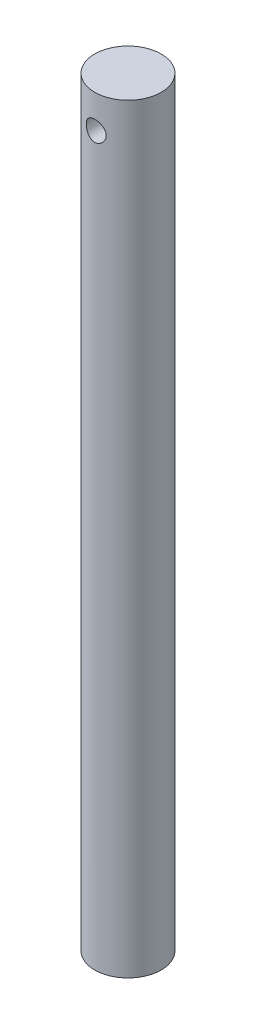
ISO-10303-21;
HEADER;
FILE_DESCRIPTION(('STEP AP214'),'2;1');
FILE_NAME('part.step','',(''),(''),'','','');
FILE_SCHEMA(('AUTOMOTIVE_DESIGN { 1 0 10303 214 1 1 1 1 }'));
ENDSEC;
DATA;
#1=APPLICATION_CONTEXT('core data for automotive mechanical design processes');
#2=APPLICATION_PROTOCOL_DEFINITION('international standard','automotive_design',2000,#1);
#3=PRODUCT_CONTEXT('',#1,'mechanical');
#4=PRODUCT('Part','Part','',(#3));
#5=PRODUCT_RELATED_PRODUCT_CATEGORY('part','',(#4));
#6=PRODUCT_DEFINITION_FORMATION('','',#4);
#7=PRODUCT_DEFINITION_CONTEXT('part definition',#1,'design');
#8=PRODUCT_DEFINITION('design','',#6,#7);
#9=PRODUCT_DEFINITION_SHAPE('','',#8);
#10=(LENGTH_UNIT() NAMED_UNIT(*) SI_UNIT(.MILLI.,.METRE.));
#11=(NAMED_UNIT(*) PLANE_ANGLE_UNIT() SI_UNIT($,.RADIAN.));
#12=(NAMED_UNIT(*) SI_UNIT($,.STERADIAN.) SOLID_ANGLE_UNIT());
#13=UNCERTAINTY_MEASURE_WITH_UNIT(LENGTH_MEASURE(1.E-05),#10,'distance_accuracy_value','');
#14=(GEOMETRIC_REPRESENTATION_CONTEXT(3) GLOBAL_UNCERTAINTY_ASSIGNED_CONTEXT((#13)) GLOBAL_UNIT_ASSIGNED_CONTEXT((#10,
#11,#12)) REPRESENTATION_CONTEXT('',''));
#15=CARTESIAN_POINT('',(0.,0.,0.));
#16=DIRECTION('',(0.,0.,1.));
#17=DIRECTION('',(1.,0.,0.));
#18=AXIS2_PLACEMENT_3D('',#15,#16,#17);
#19=CARTESIAN_POINT('',(0.,228.6,0.));
#20=DIRECTION('',(0.,-1.,0.));
#21=DIRECTION('',(0.,0.,-1.));
#22=AXIS2_PLACEMENT_3D('',#19,#20,#21);
#23=CYLINDRICAL_SURFACE('',#22,9.9949);
#24=CARTESIAN_POINT('',(0.,221.5896,-9.9949));
#25=CARTESIAN_POINT('',(-0.16442684298399,221.589597998131,-9.99489858087109));
#26=CARTESIAN_POINT('',(-0.328873941601209,221.576024419951,-9.99080371240926));
#27=CARTESIAN_POINT('',(-0.652979511357908,221.52221748529,-9.97486852417241));
#28=CARTESIAN_POINT('',(-0.812636535845261,221.481976157927,-9.96302588863465));
#29=CARTESIAN_POINT('',(-1.12244035699956,221.376297982412,-9.9328928247996));
#30=CARTESIAN_POINT('',(-1.27260079914968,221.310898287897,-9.91461190784244));
#31=CARTESIAN_POINT('',(-1.55982435941824,221.15691213085,-9.87350249880839));
#32=CARTESIAN_POINT('',(-1.69688573519602,221.068322589621,-9.85067340300872));
#33=CARTESIAN_POINT('',(-1.95795263235336,220.867793591909,-9.80217048740567));
#34=CARTESIAN_POINT('',(-2.08152932134505,220.755309969661,-9.7764384069793));
#35=CARTESIAN_POINT('',(-2.30837799378338,220.511345628808,-9.72537734991289));
#36=CARTESIAN_POINT('',(-2.4116465640126,220.379861723228,-9.70004844169098));
#37=CARTESIAN_POINT('',(-2.59720361094302,220.098001419707,-9.65204523731163));
#38=CARTESIAN_POINT('',(-2.67896877768402,219.9472670221,-9.62944334140301));
#39=CARTESIAN_POINT('',(-2.81581515849115,219.633400433198,-9.59032391952106));
#40=CARTESIAN_POINT('',(-2.87090277419694,219.470271227085,-9.57380493409917));
#41=CARTESIAN_POINT('',(-2.95128419701179,219.141060745952,-9.54932878749753));
#42=CARTESIAN_POINT('',(-2.97736853112856,218.975189790997,-9.54114499221537));
#43=CARTESIAN_POINT('',(-3.0014714369832,218.641239682755,-9.53359161589373));
#44=CARTESIAN_POINT('',(-2.99949680228921,218.473161073826,-9.53421990129459));
#45=CARTESIAN_POINT('',(-2.96815877752675,218.14599451393,-9.54401882935443));
#46=CARTESIAN_POINT('',(-2.93978566726014,217.986800924793,-9.55288059467273));
#47=CARTESIAN_POINT('',(-2.8580560135557,217.675546052717,-9.57764830395428));
#48=CARTESIAN_POINT('',(-2.80469700637537,217.523485474758,-9.59355494257117));
#49=CARTESIAN_POINT('',(-2.67378048751326,217.228390215183,-9.63086672733749));
#50=CARTESIAN_POINT('',(-2.59590169818158,217.085507596956,-9.65234416699735));
#51=CARTESIAN_POINT('',(-2.41837961838716,216.814507136893,-9.6983428211435));
#52=CARTESIAN_POINT('',(-2.31873105718593,216.686392882162,-9.72286477212291));
#53=CARTESIAN_POINT('',(-2.09557934498604,216.44294906376,-9.77344224359761));
#54=CARTESIAN_POINT('',(-1.97125436817669,216.328375953041,-9.79951906086264));
#55=CARTESIAN_POINT('',(-1.70483075153731,216.121529163998,-9.849361371147));
#56=CARTESIAN_POINT('',(-1.56273099572517,216.029256886889,-9.873126718875));
#57=CARTESIAN_POINT('',(-1.26341746982466,215.869172207907,-9.91588511821337));
#58=CARTESIAN_POINT('',(-1.10610898283771,215.801527502291,-9.93484519339709));
#59=CARTESIAN_POINT('',(-0.781647618707577,215.693878295851,-9.96561909978023));
#60=CARTESIAN_POINT('',(-0.614497499077755,215.653866092336,-9.97743492236));
#61=CARTESIAN_POINT('',(-0.281528534607556,215.603876786605,-9.9922740874606));
#62=CARTESIAN_POINT('',(-0.115876749002344,215.592874451727,-9.99559742485153));
#63=CARTESIAN_POINT('',(0.214916989810312,215.598343781687,-9.99395722435403));
#64=CARTESIAN_POINT('',(0.380059008070564,215.614811782335,-9.98899479168043));
#65=CARTESIAN_POINT('',(0.701276680789801,215.673925308989,-9.97153699772691));
#66=CARTESIAN_POINT('',(0.857472823819491,215.715971871439,-9.95921410990189));
#67=CARTESIAN_POINT('',(1.16055951414517,215.824328430166,-9.92846171034988));
#68=CARTESIAN_POINT('',(1.30744894074096,215.89064134207,-9.91003146484297));
#69=CARTESIAN_POINT('',(1.5915256128231,216.047369946027,-9.86844325400058));
#70=CARTESIAN_POINT('',(1.72840999712303,216.138307485203,-9.84518582849695));
#71=CARTESIAN_POINT('',(1.98532501626533,216.34106972648,-9.7966133840772));
#72=CARTESIAN_POINT('',(2.10535141678262,216.452899659877,-9.7712978507253));
#73=CARTESIAN_POINT('',(2.32965675013691,216.699088839287,-9.7203112387702));
#74=CARTESIAN_POINT('',(2.43320630832081,216.834118297033,-9.69466058669442));
#75=CARTESIAN_POINT('',(2.6162275791249,217.120194313019,-9.64688333981351));
#76=CARTESIAN_POINT('',(2.69569992531369,217.271240449654,-9.62475665228593));
#77=CARTESIAN_POINT('',(2.8277670179081,217.584580153937,-9.58678718947881));
#78=CARTESIAN_POINT('',(2.88048714296747,217.746817129459,-9.57091518037235));
#79=CARTESIAN_POINT('',(2.95770172631096,218.078430701162,-9.54733930963211));
#80=CARTESIAN_POINT('',(2.98220584694818,218.247804832671,-9.53963265190896));
#81=CARTESIAN_POINT('',(3.00163637229922,218.58130810317,-9.53353533998712));
#82=CARTESIAN_POINT('',(2.99775170444714,218.745362032339,-9.53477019327896));
#83=CARTESIAN_POINT('',(2.96335257746519,219.070363557825,-9.54551648645263));
#84=CARTESIAN_POINT('',(2.9328391830269,219.231311278075,-9.55502759542638));
#85=CARTESIAN_POINT('',(2.84681595546194,219.543589856533,-9.58100364226944));
#86=CARTESIAN_POINT('',(2.79162067623233,219.695015196045,-9.59738091638628));
#87=CARTESIAN_POINT('',(2.658045369549,219.986577016794,-9.63522795606684));
#88=CARTESIAN_POINT('',(2.57966090745515,220.126711332238,-9.65669869553613));
#89=CARTESIAN_POINT('',(2.39859113840193,220.397231033556,-9.70328890761621));
#90=CARTESIAN_POINT('',(2.29512513778803,220.527075886912,-9.72851274615022));
#91=CARTESIAN_POINT('',(2.06823484121448,220.767945647025,-9.77925990278095));
#92=CARTESIAN_POINT('',(1.94480536841877,220.878965656873,-9.80478329696059));
#93=CARTESIAN_POINT('',(1.67715067360337,221.08226488957,-9.85414729951976));
#94=CARTESIAN_POINT('',(1.53242343607487,221.173902183212,-9.87791700349054));
#95=CARTESIAN_POINT('',(1.22890356266907,221.331415140482,-9.92024395444393));
#96=CARTESIAN_POINT('',(1.07011755847266,221.397302871898,-9.93880364200073));
#97=CARTESIAN_POINT('',(0.760603073441884,221.495529162443,-9.96699631681891));
#98=CARTESIAN_POINT('',(0.610839797881182,221.530710177143,-9.97737376515099));
#99=CARTESIAN_POINT('',(0.307389808955361,221.577744585926,-9.9913257026286));
#100=CARTESIAN_POINT('',(0.153703754397658,221.589601871317,-9.99490132658048));
#101=CARTESIAN_POINT('',(0.,221.5896,-9.9949));
#102=B_SPLINE_CURVE_WITH_KNOTS('',3,(#24,#25,#26,#27,#28,#29,#30,#31,#32,#33,#34,#35,#36,#37,
#38,#39,#40,#41,#42,#43,#44,#45,#46,#47,#48,#49,#50,#51,#52,#53,#54,#55,#56,#57,#58,#59,#60,#61,
#62,#63,#64,#65,#66,#67,#68,#69,#70,#71,#72,#73,#74,#75,#76,#77,#78,#79,#80,#81,#82,#83,#84,#85,
#86,#87,#88,#89,#90,#91,#92,#93,#94,#95,#96,#97,#98,#99,#100,#101),.UNSPECIFIED.,.T.,.F.,(4,2,2,
2,2,2,2,2,2,2,2,2,2,2,2,2,2,2,2,2,2,2,2,2,2,2,2,2,2,2,2,2,2,2,2,2,2,2,4),(0.,0.492715943924644,
0.985579225118158,1.47771742753045,1.96992099967514,2.47484195027415,2.97984769133751,
3.49619592174448,4.01242018592874,4.51420004571544,5.015858417874,5.49942564768715,
5.98304056984833,6.47327619008386,6.96363063439441,7.47444444787528,7.98529034870171,
8.49955241576373,9.01367107187622,9.50936048813476,10.004983791101,10.4894255168657,
10.9739254679042,11.4696279186714,11.9654546563037,12.479271471351,12.9930747646302,
13.5044472642064,14.0156445960872,14.5055594064386,14.9954546295118,15.4792769339165,
15.96319182314,16.4647211929473,16.9663808261823,17.4826896789657,17.9987562674751,
18.4594166276644,18.9200001252152),.UNSPECIFIED.);
#103=CARTESIAN_POINT('',(0.,221.5896,-9.9949));
#104=VERTEX_POINT('',#103);
#105=EDGE_CURVE('E10',#104,#104,#102,.T.);
#106=ORIENTED_EDGE('',*,*,#105,.T.);
#107=EDGE_LOOP('',(#106));
#108=FACE_BOUND('',#107,.T.);
#109=CARTESIAN_POINT('',(2.9972,218.5924,9.53492622782159));
#110=CARTESIAN_POINT('',(2.99719794571829,218.428160795761,9.53492793280023));
#111=CARTESIAN_POINT('',(2.98365423307907,218.26390126482,9.53921619582068));
#112=CARTESIAN_POINT('',(2.92997666983017,217.940184242528,9.55583744560146));
#113=CARTESIAN_POINT('',(2.889833917451,217.780728377482,9.56817312552976));
#114=CARTESIAN_POINT('',(2.784443668721,217.471351961766,9.59936917935017));
#115=CARTESIAN_POINT('',(2.71923790055679,217.321416041965,9.61821870290596));
#116=CARTESIAN_POINT('',(2.56570965538061,217.034574898563,9.66030389008638));
#117=CARTESIAN_POINT('',(2.4773837241305,216.897671626259,9.68354020896976));
#118=CARTESIAN_POINT('',(2.27713217646146,216.636452902669,9.73260486600448));
#119=CARTESIAN_POINT('',(2.16460295871828,216.512610432959,9.7584883905919));
#120=CARTESIAN_POINT('',(1.92043267052248,216.285241280478,9.80945958418983));
#121=CARTESIAN_POINT('',(1.78878914922247,216.181717206952,9.8345471506387));
#122=CARTESIAN_POINT('',(1.50676276063952,215.995869951499,9.88172655501062));
#123=CARTESIAN_POINT('',(1.3560489230281,215.914028978444,9.90374579122349));
#124=CARTESIAN_POINT('',(1.0422251266608,215.777037050031,9.94166641531708));
#125=CARTESIAN_POINT('',(0.879117847758532,215.721880343586,9.95756912130208));
#126=CARTESIAN_POINT('',(0.550085400517267,215.641387764346,9.98107439758818));
#127=CARTESIAN_POINT('',(0.384374041056853,215.615244566414,9.98890122350711));
#128=CARTESIAN_POINT('',(0.0507446907015113,215.590968388588,9.99616259272994));
#129=CARTESIAN_POINT('',(-0.117172829704446,215.592829530303,9.99559889728853));
#130=CARTESIAN_POINT('',(-0.444784300474384,215.62396719814,9.98630127480786));
#131=CARTESIAN_POINT('',(-0.6045699044514,215.65236946202,9.97782790133125));
#132=CARTESIAN_POINT('',(-0.916992583381413,215.734355085173,9.95397963437487));
#133=CARTESIAN_POINT('',(-1.06962920510459,215.787940038605,9.93860430397843));
#134=CARTESIAN_POINT('',(-1.36549995286965,215.919362266936,9.90231940185882));
#135=CARTESIAN_POINT('',(-1.50860394087418,215.997474600516,9.88134748984467));
#136=CARTESIAN_POINT('',(-1.77995271258828,216.175516693696,9.83609400730122));
#137=CARTESIAN_POINT('',(-1.90819396236297,216.275451625863,9.81181165261793));
#138=CARTESIAN_POINT('',(-2.15139426377635,216.498836685384,9.7614320965833));
#139=CARTESIAN_POINT('',(-2.2656514654951,216.623044292209,9.73530101711013));
#140=CARTESIAN_POINT('',(-2.47191305204416,216.889111727968,9.68498699543894));
#141=CARTESIAN_POINT('',(-2.56391522933647,217.030973305937,9.66080424665982));
#142=CARTESIAN_POINT('',(-2.7237863402352,217.330168451635,9.61696319064409));
#143=CARTESIAN_POINT('',(-2.79141579152503,217.487637143765,9.59735041657235));
#144=CARTESIAN_POINT('',(-2.89898853528615,217.81245333719,9.56541041304228));
#145=CARTESIAN_POINT('',(-2.93894085069857,217.979797599655,9.55308080941241));
#146=CARTESIAN_POINT('',(-2.98871369828877,218.3129354407,9.53762415943319));
#147=CARTESIAN_POINT('',(-2.9996010271651,218.478554652333,9.53417147957845));
#148=CARTESIAN_POINT('',(-2.99391377455864,218.809258374797,9.53595920588732));
#149=CARTESIAN_POINT('',(-2.97734303333595,218.974342957165,9.54119839641415));
#150=CARTESIAN_POINT('',(-2.91816003264667,219.294842846037,9.55945996273733));
#151=CARTESIAN_POINT('',(-2.8762347092137,219.450397901873,9.57227683683488));
#152=CARTESIAN_POINT('',(-2.7683290867618,219.752255144402,9.60403677186795));
#153=CARTESIAN_POINT('',(-2.70234507577444,219.898555899177,9.62298077809589));
#154=CARTESIAN_POINT('',(-2.54617106574866,220.182090809387,9.66549209073185));
#155=CARTESIAN_POINT('',(-2.4553793034864,220.318976544886,9.68916977118687));
#156=CARTESIAN_POINT('',(-2.25288179885987,220.575959403815,9.73824337171042));
#157=CARTESIAN_POINT('',(-2.14117105498554,220.696052500281,9.76363970176086));
#158=CARTESIAN_POINT('',(-1.8949915105132,220.920706484558,9.81444792509988));
#159=CARTESIAN_POINT('',(-1.75982344809421,221.024511024167,9.83982430209324));
#160=CARTESIAN_POINT('',(-1.47338205096479,221.207982861327,9.88676907455706));
#161=CARTESIAN_POINT('',(-1.32210951708198,221.287651358335,9.90833765923609));
#162=CARTESIAN_POINT('',(-1.0087535588643,221.419821048016,9.94510494439463));
#163=CARTESIAN_POINT('',(-0.846761588967989,221.472525207047,9.96035106542677));
#164=CARTESIAN_POINT('',(-0.515680907412847,221.549789830611,9.98296497055234));
#165=CARTESIAN_POINT('',(-0.34659423867848,221.574358339952,9.99033500660966));
#166=CARTESIAN_POINT('',(-0.0131140247067268,221.594042880283,9.99622936683349));
#167=CARTESIAN_POINT('',(0.15120975481089,221.590255826435,9.99508314988318));
#168=CARTESIAN_POINT('',(0.476777804501486,221.555958685718,9.98485017498632));
#169=CARTESIAN_POINT('',(0.63802224849897,221.525450111828,9.97576386660958));
#170=CARTESIAN_POINT('',(0.951171333871952,221.439254554857,9.95076543674387));
#171=CARTESIAN_POINT('',(1.10315757601555,221.383841025615,9.93492754174808));
#172=CARTESIAN_POINT('',(1.39575481846892,221.249653148999,9.89806368240138));
#173=CARTESIAN_POINT('',(1.53636394551103,221.170874964506,9.87703686598176));
#174=CARTESIAN_POINT('',(1.80710262979837,220.989273161291,9.83116840610788));
#175=CARTESIAN_POINT('',(1.9367532964733,220.885761186341,9.80622627536802));
#176=CARTESIAN_POINT('',(2.17721110107329,220.658870037632,9.75566016213013));
#177=CARTESIAN_POINT('',(2.28801279477581,220.535485143866,9.73003598509709));
#178=CARTESIAN_POINT('',(2.49094028141121,220.267942050496,9.68010884486464));
#179=CARTESIAN_POINT('',(2.58241185091724,220.123274756666,9.65586792860669));
#180=CARTESIAN_POINT('',(2.73962938323571,219.819913992006,9.61244754471584));
#181=CARTESIAN_POINT('',(2.80538772646736,219.661227316468,9.59326564271762));
#182=CARTESIAN_POINT('',(2.90337683735732,219.352009017536,9.5640344028703));
#183=CARTESIAN_POINT('',(2.93846362639192,219.202450341816,9.55322195690563));
#184=CARTESIAN_POINT('',(2.98537384082869,218.8993998345,9.53866777983388));
#185=CARTESIAN_POINT('',(2.99720192006722,218.745908795959,9.53492463423606));
#186=CARTESIAN_POINT('',(2.9972,218.5924,9.53492622782159));
#187=B_SPLINE_CURVE_WITH_KNOTS('',3,(#109,#110,#111,#112,#113,#114,#115,#116,#117,#118,#119,
#120,#121,#122,#123,#124,#125,#126,#127,#128,#129,#130,#131,#132,#133,#134,#135,#136,#137,#138,
#139,#140,#141,#142,#143,#144,#145,#146,#147,#148,#149,#150,#151,#152,#153,#154,#155,#156,#157,
#158,#159,#160,#161,#162,#163,#164,#165,#166,#167,#168,#169,#170,#171,#172,#173,#174,#175,#176,
#177,#178,#179,#180,#181,#182,#183,#184,#185,#186),.UNSPECIFIED.,.T.,.F.,(4,2,2,2,2,2,2,2,2,2,2,
2,2,2,2,2,2,2,2,2,2,2,2,2,2,2,2,2,2,2,2,2,2,2,2,2,2,2,4),(0.,0.492151346365951,
0.984467481840859,1.4759674708864,1.96754093380773,2.47319718774647,2.97891833458046,
3.4950878925571,4.0111461542615,4.51245356254416,5.01365574285154,5.49890930059679,
5.98419358082771,6.47512703127229,6.96617697323045,7.47614081294816,7.98615521667885,
8.5010524507693,9.01578174564269,9.51134070828789,10.0068303683678,10.4894620744095,
10.9721682762965,11.4678211663348,11.9635927134596,12.4780568001175,12.9924953159404,
13.5030023643218,14.0133634072595,14.5040864490473,14.9947817077832,15.4802160428886,
15.9657301438903,16.4667697418124,16.9679538121489,17.4840589956567,17.9999153776574,
18.4600045642815,18.9200016822669),.UNSPECIFIED.);
#188=CARTESIAN_POINT('',(2.9972,218.5924,9.53492622782159));
#189=VERTEX_POINT('',#188);
#190=EDGE_CURVE('E50',#189,#189,#187,.T.);
#191=ORIENTED_EDGE('',*,*,#190,.T.);
#192=EDGE_LOOP('',(#191));
#193=FACE_BOUND('',#192,.T.);
#194=CARTESIAN_POINT('',(0.,228.6,0.));
#195=DIRECTION('',(0.,1.,0.));
#196=DIRECTION('',(0.,0.,1.));
#197=AXIS2_PLACEMENT_3D('',#194,#195,#196);
#198=CIRCLE('',#197,9.9949);
#199=CARTESIAN_POINT('',(0.,228.6,9.9949));
#200=VERTEX_POINT('',#199);
#201=EDGE_CURVE('E57',#200,#200,#198,.T.);
#202=ORIENTED_EDGE('',*,*,#201,.F.);
#203=EDGE_LOOP('',(#202));
#204=FACE_BOUND('',#203,.T.);
#205=CARTESIAN_POINT('',(0.,0.,0.));
#206=DIRECTION('',(0.,1.,0.));
#207=DIRECTION('',(0.,0.,1.));
#208=AXIS2_PLACEMENT_3D('',#205,#206,#207);
#209=CIRCLE('',#208,9.9949);
#210=CARTESIAN_POINT('',(0.,0.,9.9949));
#211=VERTEX_POINT('',#210);
#212=EDGE_CURVE('E61',#211,#211,#209,.T.);
#213=ORIENTED_EDGE('',*,*,#212,.T.);
#214=EDGE_LOOP('',(#213));
#215=FACE_BOUND('',#214,.T.);
#216=ADVANCED_FACE('F38',(#108,#193,#204,#215),#23,.T.);
#217=CARTESIAN_POINT('',(0.,228.6,0.));
#218=DIRECTION('',(0.,1.,0.));
#219=DIRECTION('',(0.,0.,1.));
#220=AXIS2_PLACEMENT_3D('',#217,#218,#219);
#221=PLANE('',#220);
#222=ORIENTED_EDGE('',*,*,#201,.T.);
#223=EDGE_LOOP('',(#222));
#224=FACE_BOUND('',#223,.T.);
#225=ADVANCED_FACE('F73',(#224),#221,.T.);
#226=CARTESIAN_POINT('',(0.,0.,0.));
#227=DIRECTION('',(0.,1.,0.));
#228=DIRECTION('',(0.,0.,1.));
#229=AXIS2_PLACEMENT_3D('',#226,#227,#228);
#230=PLANE('',#229);
#231=ORIENTED_EDGE('',*,*,#212,.F.);
#232=EDGE_LOOP('',(#231));
#233=FACE_BOUND('',#232,.T.);
#234=ADVANCED_FACE('F71',(#233),#230,.F.);
#235=CARTESIAN_POINT('',(0.,218.5924,-9.9949));
#236=DIRECTION('',(0.,0.,1.));
#237=DIRECTION('',(1.,0.,0.));
#238=AXIS2_PLACEMENT_3D('',#235,#236,#237);
#239=CYLINDRICAL_SURFACE('',#238,2.9972);
#240=ORIENTED_EDGE('',*,*,#190,.F.);
#241=EDGE_LOOP('',(#240));
#242=FACE_BOUND('',#241,.T.);
#243=ORIENTED_EDGE('',*,*,#105,.F.);
#244=EDGE_LOOP('',(#243));
#245=FACE_BOUND('',#244,.T.);
#246=ADVANCED_FACE('F67',(#242,#245),#239,.F.);
#247=CLOSED_SHELL('',(#216,#225,#234,#246));
#248=MANIFOLD_SOLID_BREP('B2',#247);
#249=ADVANCED_BREP_SHAPE_REPRESENTATION('',(#18,#248),#14);
#250=SHAPE_DEFINITION_REPRESENTATION(#9,#249);
ENDSEC;
END-ISO-10303-21;
